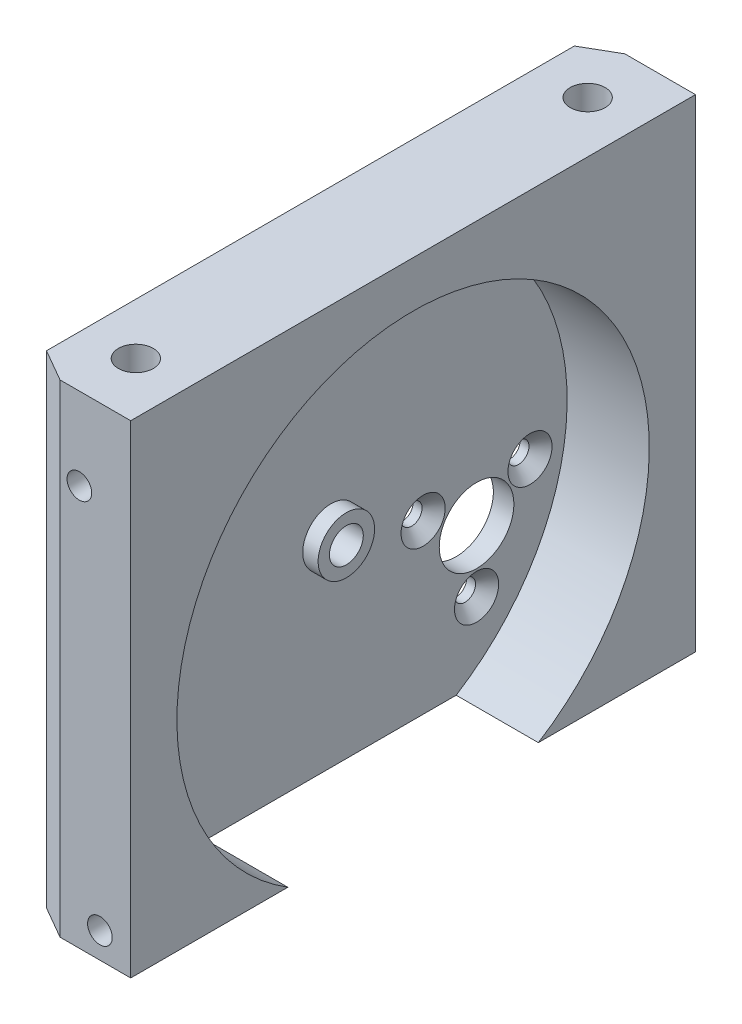
ISO-10303-21;
HEADER;
FILE_DESCRIPTION(('STEP AP214'),'2;1');
FILE_NAME('part.step','',(''),(''),'','','');
FILE_SCHEMA(('AUTOMOTIVE_DESIGN { 1 0 10303 214 1 1 1 1 }'));
ENDSEC;
DATA;
#1=APPLICATION_CONTEXT('core data for automotive mechanical design processes');
#2=APPLICATION_PROTOCOL_DEFINITION('international standard','automotive_design',2000,#1);
#3=PRODUCT_CONTEXT('',#1,'mechanical');
#4=PRODUCT('Part','Part','',(#3));
#5=PRODUCT_RELATED_PRODUCT_CATEGORY('part','',(#4));
#6=PRODUCT_DEFINITION_FORMATION('','',#4);
#7=PRODUCT_DEFINITION_CONTEXT('part definition',#1,'design');
#8=PRODUCT_DEFINITION('design','',#6,#7);
#9=PRODUCT_DEFINITION_SHAPE('','',#8);
#10=(LENGTH_UNIT() NAMED_UNIT(*) SI_UNIT(.MILLI.,.METRE.));
#11=(NAMED_UNIT(*) PLANE_ANGLE_UNIT() SI_UNIT($,.RADIAN.));
#12=(NAMED_UNIT(*) SI_UNIT($,.STERADIAN.) SOLID_ANGLE_UNIT());
#13=UNCERTAINTY_MEASURE_WITH_UNIT(LENGTH_MEASURE(1.E-05),#10,'distance_accuracy_value','');
#14=(GEOMETRIC_REPRESENTATION_CONTEXT(3) GLOBAL_UNCERTAINTY_ASSIGNED_CONTEXT((#13)) GLOBAL_UNIT_ASSIGNED_CONTEXT((#10,
#11,#12)) REPRESENTATION_CONTEXT('',''));
#15=CARTESIAN_POINT('',(0.,0.,0.));
#16=DIRECTION('',(0.,0.,1.));
#17=DIRECTION('',(1.,0.,0.));
#18=AXIS2_PLACEMENT_3D('',#15,#16,#17);
#19=CARTESIAN_POINT('',(2.,5.6254512635379,14.6813158662437));
#20=DIRECTION('',(1.,0.,0.));
#21=DIRECTION('',(0.,0.,-1.));
#22=AXIS2_PLACEMENT_3D('',#19,#20,#21);
#23=PLANE('',#22);
#24=CARTESIAN_POINT('',(2.,2.4504512635379,5.70631586624369));
#25=DIRECTION('',(1.,0.,0.));
#26=DIRECTION('',(0.,0.,-1.));
#27=AXIS2_PLACEMENT_3D('',#24,#25,#26);
#28=CIRCLE('',#27,2.15);
#29=CARTESIAN_POINT('',(2.,2.4504512635379,3.55631586624369));
#30=VERTEX_POINT('',#29);
#31=EDGE_CURVE('E126',#30,#30,#28,.T.);
#32=ORIENTED_EDGE('',*,*,#31,.F.);
#33=EDGE_LOOP('',(#32));
#34=FACE_BOUND('',#33,.T.);
#35=CARTESIAN_POINT('',(2.,2.4504512635379,-4.70368413375631));
#36=DIRECTION('',(1.,0.,0.));
#37=DIRECTION('',(0.,0.,-1.));
#38=AXIS2_PLACEMENT_3D('',#35,#36,#37);
#39=CIRCLE('',#38,2.15);
#40=CARTESIAN_POINT('',(2.,2.4504512635379,-6.85368413375631));
#41=VERTEX_POINT('',#40);
#42=EDGE_CURVE('E135',#41,#41,#39,.T.);
#43=ORIENTED_EDGE('',*,*,#42,.F.);
#44=EDGE_LOOP('',(#43));
#45=FACE_BOUND('',#44,.T.);
#46=CARTESIAN_POINT('',(2.,-6.5645487364621,0.501315866243686));
#47=DIRECTION('',(1.,0.,0.));
#48=DIRECTION('',(0.,0.,-1.));
#49=AXIS2_PLACEMENT_3D('',#46,#47,#48);
#50=CIRCLE('',#49,2.15);
#51=CARTESIAN_POINT('',(2.,-6.5645487364621,-1.64868413375631));
#52=VERTEX_POINT('',#51);
#53=EDGE_CURVE('E144',#52,#52,#50,.T.);
#54=ORIENTED_EDGE('',*,*,#53,.F.);
#55=EDGE_LOOP('',(#54));
#56=FACE_BOUND('',#55,.T.);
#57=CARTESIAN_POINT('',(2.,-0.5545487364621,0.501315866243685));
#58=DIRECTION('',(1.,0.,0.));
#59=DIRECTION('',(0.,0.,-1.));
#60=AXIS2_PLACEMENT_3D('',#57,#58,#59);
#61=CIRCLE('',#60,3.635);
#62=CARTESIAN_POINT('',(2.,-0.5545487364621,-3.13368413375632));
#63=VERTEX_POINT('',#62);
#64=EDGE_CURVE('E156',#63,#63,#61,.T.);
#65=ORIENTED_EDGE('',*,*,#64,.F.);
#66=EDGE_LOOP('',(#65));
#67=FACE_BOUND('',#66,.T.);
#68=DIRECTION('',(0.,0.,-1.));
#69=VECTOR('',#68,1.);
#70=CARTESIAN_POINT('',(2.,-13.8745487364621,42.1813158662437));
#71=LINE('',#70,#69);
#72=CARTESIAN_POINT('',(2.,-13.8745487364621,26.8776267838942));
#73=VERTEX_POINT('',#72);
#74=CARTESIAN_POINT('',(2.,-13.8745487364621,2.48500494859321));
#75=VERTEX_POINT('',#74);
#76=EDGE_CURVE('E234',#73,#75,#71,.T.);
#77=ORIENTED_EDGE('',*,*,#76,.T.);
#78=CARTESIAN_POINT('',(2.,5.6254512635379,14.6813158662437));
#79=DIRECTION('',(1.,0.,0.));
#80=DIRECTION('',(0.,0.,-1.));
#81=AXIS2_PLACEMENT_3D('',#78,#79,#80);
#82=CIRCLE('',#81,23.);
#83=EDGE_CURVE('E193',#75,#73,#82,.T.);
#84=ORIENTED_EDGE('',*,*,#83,.T.);
#85=EDGE_LOOP('',(#77,#84));
#86=FACE_BOUND('',#85,.T.);
#87=CARTESIAN_POINT('',(2.,5.6254512635379,14.6813158662437));
#88=DIRECTION('',(1.,0.,0.));
#89=DIRECTION('',(0.,0.,-1.));
#90=AXIS2_PLACEMENT_3D('',#87,#88,#89);
#91=CIRCLE('',#90,2.75);
#92=CARTESIAN_POINT('',(2.,5.6254512635379,11.9313158662437));
#93=VERTEX_POINT('',#92);
#94=EDGE_CURVE('E165',#93,#93,#91,.T.);
#95=ORIENTED_EDGE('',*,*,#94,.F.);
#96=EDGE_LOOP('',(#95));
#97=FACE_BOUND('',#96,.T.);
#98=ADVANCED_FACE('F34',(#34,#45,#56,#67,#86,#97),#23,.T.);
#99=CARTESIAN_POINT('',(10.,33.1254512635379,42.1813158662437));
#100=DIRECTION('',(0.,0.,-1.));
#101=DIRECTION('',(-1.,0.,0.));
#102=AXIS2_PLACEMENT_3D('',#99,#100,#101);
#103=PLANE('',#102);
#104=CARTESIAN_POINT('',(7.,-11.3745487364621,42.1813158662437));
#105=DIRECTION('',(0.,0.,1.));
#106=DIRECTION('',(1.,0.,0.));
#107=AXIS2_PLACEMENT_3D('',#104,#105,#106);
#108=CIRCLE('',#107,1.2);
#109=CARTESIAN_POINT('',(8.2,-11.3745487364621,42.1813158662437));
#110=VERTEX_POINT('',#109);
#111=EDGE_CURVE('E181',#110,#110,#108,.T.);
#112=ORIENTED_EDGE('',*,*,#111,.F.);
#113=EDGE_LOOP('',(#112));
#114=FACE_BOUND('',#113,.T.);
#115=CARTESIAN_POINT('',(5.,25.1254512635379,42.1813158662437));
#116=DIRECTION('',(0.,0.,1.));
#117=DIRECTION('',(1.,0.,0.));
#118=AXIS2_PLACEMENT_3D('',#115,#116,#117);
#119=CIRCLE('',#118,1.2);
#120=CARTESIAN_POINT('',(6.2,25.1254512635379,42.1813158662437));
#121=VERTEX_POINT('',#120);
#122=EDGE_CURVE('E187',#121,#121,#119,.T.);
#123=ORIENTED_EDGE('',*,*,#122,.F.);
#124=EDGE_LOOP('',(#123));
#125=FACE_BOUND('',#124,.T.);
#126=DIRECTION('',(-1.,0.,0.));
#127=VECTOR('',#126,1.);
#128=CARTESIAN_POINT('',(10.,33.1254512635379,42.1813158662437));
#129=LINE('',#128,#127);
#130=CARTESIAN_POINT('',(10.,33.1254512635379,42.1813158662437));
#131=VERTEX_POINT('',#130);
#132=CARTESIAN_POINT('',(3.11769145362399,33.1254512635379,42.1813158662437));
#133=VERTEX_POINT('',#132);
#134=EDGE_CURVE('E217',#131,#133,#129,.T.);
#135=ORIENTED_EDGE('',*,*,#134,.T.);
#136=DIRECTION('',(0.,-1.,0.));
#137=VECTOR('',#136,1.);
#138=CARTESIAN_POINT('',(3.11769145362398,33.1254512635379,42.1813158662437));
#139=LINE('',#138,#137);
#140=CARTESIAN_POINT('',(3.11769145362399,-13.8745487364621,42.1813158662437));
#141=VERTEX_POINT('',#140);
#142=EDGE_CURVE('E236',#133,#141,#139,.T.);
#143=ORIENTED_EDGE('',*,*,#142,.T.);
#144=DIRECTION('',(-1.,0.,0.));
#145=VECTOR('',#144,1.);
#146=CARTESIAN_POINT('',(10.,-13.8745487364621,42.1813158662437));
#147=LINE('',#146,#145);
#148=CARTESIAN_POINT('',(10.,-13.8745487364621,42.1813158662437));
#149=VERTEX_POINT('',#148);
#150=EDGE_CURVE('E229',#149,#141,#147,.T.);
#151=ORIENTED_EDGE('',*,*,#150,.F.);
#152=DIRECTION('',(0.,-1.,0.));
#153=VECTOR('',#152,1.);
#154=CARTESIAN_POINT('',(10.,33.1254512635379,42.1813158662437));
#155=LINE('',#154,#153);
#156=EDGE_CURVE('E205',#131,#149,#155,.T.);
#157=ORIENTED_EDGE('',*,*,#156,.F.);
#158=EDGE_LOOP('',(#135,#143,#151,#157));
#159=FACE_BOUND('',#158,.T.);
#160=ADVANCED_FACE('F255',(#114,#125,#159),#103,.F.);
#161=CARTESIAN_POINT('',(10.,-13.8745487364621,42.1813158662437));
#162=DIRECTION('',(0.,1.,0.));
#163=DIRECTION('',(0.,0.,1.));
#164=AXIS2_PLACEMENT_3D('',#161,#162,#163);
#165=PLANE('',#164);
#166=ORIENTED_EDGE('',*,*,#150,.T.);
#167=DIRECTION('',(0.866025403784438,0.,0.500000000000001));
#168=VECTOR('',#167,1.);
#169=CARTESIAN_POINT('',(3.11769145362398,-13.8745487364621,42.1813158662437));
#170=LINE('',#169,#168);
#171=CARTESIAN_POINT('',(0.,-13.8745487364621,40.3813158662437));
#172=VERTEX_POINT('',#171);
#173=EDGE_CURVE('E241',#141,#172,#170,.F.);
#174=ORIENTED_EDGE('',*,*,#173,.T.);
#175=DIRECTION('',(0.,0.,-1.));
#176=VECTOR('',#175,1.);
#177=CARTESIAN_POINT('',(0.,-13.8745487364621,42.1813158662437));
#178=LINE('',#177,#176);
#179=CARTESIAN_POINT('',(0.,-13.8745487364621,-11.0186841337563));
#180=VERTEX_POINT('',#179);
#181=EDGE_CURVE('E204',#172,#180,#178,.T.);
#182=ORIENTED_EDGE('',*,*,#181,.T.);
#183=DIRECTION('',(-0.866025403784439,0.,0.499999999999999));
#184=VECTOR('',#183,1.);
#185=CARTESIAN_POINT('',(3.11769145362397,-13.8745487364621,-12.8186841337563));
#186=LINE('',#185,#184);
#187=CARTESIAN_POINT('',(3.11769145362398,-13.8745487364621,-12.8186841337563));
#188=VERTEX_POINT('',#187);
#189=EDGE_CURVE('E239',#180,#188,#186,.F.);
#190=ORIENTED_EDGE('',*,*,#189,.T.);
#191=DIRECTION('',(-1.,0.,0.));
#192=VECTOR('',#191,1.);
#193=CARTESIAN_POINT('',(10.,-13.8745487364621,-12.8186841337563));
#194=LINE('',#193,#192);
#195=CARTESIAN_POINT('',(10.,-13.8745487364621,-12.8186841337563));
#196=VERTEX_POINT('',#195);
#197=EDGE_CURVE('E226',#196,#188,#194,.T.);
#198=ORIENTED_EDGE('',*,*,#197,.F.);
#199=DIRECTION('',(0.,0.,-1.));
#200=VECTOR('',#199,1.);
#201=CARTESIAN_POINT('',(10.,-13.8745487364621,42.1813158662437));
#202=LINE('',#201,#200);
#203=CARTESIAN_POINT('',(10.,-13.8745487364621,2.48500494859321));
#204=VERTEX_POINT('',#203);
#205=EDGE_CURVE('E208',#204,#196,#202,.T.);
#206=ORIENTED_EDGE('',*,*,#205,.F.);
#207=DIRECTION('',(1.,0.,0.));
#208=VECTOR('',#207,1.);
#209=CARTESIAN_POINT('',(2.,-13.8745487364621,2.48500494859321));
#210=LINE('',#209,#208);
#211=EDGE_CURVE('E198',#204,#75,#210,.F.);
#212=ORIENTED_EDGE('',*,*,#211,.T.);
#213=ORIENTED_EDGE('',*,*,#76,.F.);
#214=DIRECTION('',(1.,0.,0.));
#215=VECTOR('',#214,1.);
#216=CARTESIAN_POINT('',(2.,-13.8745487364621,26.8776267838942));
#217=LINE('',#216,#215);
#218=CARTESIAN_POINT('',(10.,-13.8745487364621,26.8776267838942));
#219=VERTEX_POINT('',#218);
#220=EDGE_CURVE('E201',#73,#219,#217,.T.);
#221=ORIENTED_EDGE('',*,*,#220,.T.);
#222=EDGE_CURVE('E210',#149,#219,#202,.T.);
#223=ORIENTED_EDGE('',*,*,#222,.F.);
#224=EDGE_LOOP('',(#166,#174,#182,#190,#198,#206,#212,#213,#221,#223));
#225=FACE_BOUND('',#224,.T.);
#226=ADVANCED_FACE('F259',(#225),#165,.F.);
#227=CARTESIAN_POINT('',(10.,33.1254512635379,-12.8186841337563));
#228=DIRECTION('',(0.,0.,1.));
#229=DIRECTION('',(0.,-1.,0.));
#230=AXIS2_PLACEMENT_3D('',#227,#228,#229);
#231=PLANE('',#230);
#232=CARTESIAN_POINT('',(7.,-11.3745487364621,-12.8186841337563));
#233=DIRECTION('',(0.,0.,-1.));
#234=DIRECTION('',(0.,1.,0.));
#235=AXIS2_PLACEMENT_3D('',#232,#233,#234);
#236=CIRCLE('',#235,1.2);
#237=CARTESIAN_POINT('',(7.,-10.1745487364621,-12.8186841337563));
#238=VERTEX_POINT('',#237);
#239=EDGE_CURVE('E169',#238,#238,#236,.T.);
#240=ORIENTED_EDGE('',*,*,#239,.F.);
#241=EDGE_LOOP('',(#240));
#242=FACE_BOUND('',#241,.T.);
#243=CARTESIAN_POINT('',(5.,25.1254512635379,-12.8186841337563));
#244=DIRECTION('',(0.,0.,-1.));
#245=DIRECTION('',(0.,1.,0.));
#246=AXIS2_PLACEMENT_3D('',#243,#244,#245);
#247=CIRCLE('',#246,1.2);
#248=CARTESIAN_POINT('',(5.,26.3254512635379,-12.8186841337563));
#249=VERTEX_POINT('',#248);
#250=EDGE_CURVE('E175',#249,#249,#247,.T.);
#251=ORIENTED_EDGE('',*,*,#250,.F.);
#252=EDGE_LOOP('',(#251));
#253=FACE_BOUND('',#252,.T.);
#254=ORIENTED_EDGE('',*,*,#197,.T.);
#255=DIRECTION('',(0.,1.,0.));
#256=VECTOR('',#255,1.);
#257=CARTESIAN_POINT('',(3.11769145362398,33.1254512635379,-12.8186841337563));
#258=LINE('',#257,#256);
#259=CARTESIAN_POINT('',(3.11769145362398,33.1254512635379,-12.8186841337563));
#260=VERTEX_POINT('',#259);
#261=EDGE_CURVE('E11',#188,#260,#258,.T.);
#262=ORIENTED_EDGE('',*,*,#261,.T.);
#263=DIRECTION('',(-1.,0.,0.));
#264=VECTOR('',#263,1.);
#265=CARTESIAN_POINT('',(10.,33.1254512635379,-12.8186841337563));
#266=LINE('',#265,#264);
#267=CARTESIAN_POINT('',(10.,33.1254512635379,-12.8186841337563));
#268=VERTEX_POINT('',#267);
#269=EDGE_CURVE('E223',#268,#260,#266,.T.);
#270=ORIENTED_EDGE('',*,*,#269,.F.);
#271=DIRECTION('',(0.,1.,0.));
#272=VECTOR('',#271,1.);
#273=CARTESIAN_POINT('',(10.,33.1254512635379,-12.8186841337563));
#274=LINE('',#273,#272);
#275=EDGE_CURVE('E213',#196,#268,#274,.T.);
#276=ORIENTED_EDGE('',*,*,#275,.F.);
#277=EDGE_LOOP('',(#254,#262,#270,#276));
#278=FACE_BOUND('',#277,.T.);
#279=ADVANCED_FACE('F266',(#242,#253,#278),#231,.F.);
#280=CARTESIAN_POINT('',(10.,33.1254512635379,42.1813158662437));
#281=DIRECTION('',(0.,-1.,0.));
#282=DIRECTION('',(0.,0.,-1.));
#283=AXIS2_PLACEMENT_3D('',#280,#281,#282);
#284=PLANE('',#283);
#285=CARTESIAN_POINT('',(5.,33.1254512635379,-7.31868413375631));
#286=DIRECTION('',(0.,1.,0.));
#287=DIRECTION('',(0.,0.,1.));
#288=AXIS2_PLACEMENT_3D('',#285,#286,#287);
#289=CIRCLE('',#288,1.7);
#290=CARTESIAN_POINT('',(5.,33.1254512635379,-5.61868413375631));
#291=VERTEX_POINT('',#290);
#292=EDGE_CURVE('E116',#291,#291,#289,.T.);
#293=ORIENTED_EDGE('',*,*,#292,.F.);
#294=EDGE_LOOP('',(#293));
#295=FACE_BOUND('',#294,.T.);
#296=CARTESIAN_POINT('',(5.,33.1254512635379,36.6813158662437));
#297=DIRECTION('',(0.,1.,0.));
#298=DIRECTION('',(0.,0.,1.));
#299=AXIS2_PLACEMENT_3D('',#296,#297,#298);
#300=CIRCLE('',#299,1.7);
#301=CARTESIAN_POINT('',(5.,33.1254512635379,38.3813158662437));
#302=VERTEX_POINT('',#301);
#303=EDGE_CURVE('E115',#302,#302,#300,.T.);
#304=ORIENTED_EDGE('',*,*,#303,.F.);
#305=EDGE_LOOP('',(#304));
#306=FACE_BOUND('',#305,.T.);
#307=DIRECTION('',(0.,0.,1.));
#308=VECTOR('',#307,1.);
#309=CARTESIAN_POINT('',(0.,33.1254512635379,42.1813158662437));
#310=LINE('',#309,#308);
#311=CARTESIAN_POINT('',(0.,33.1254512635379,-11.0186841337563));
#312=VERTEX_POINT('',#311);
#313=CARTESIAN_POINT('',(0.,33.1254512635379,40.3813158662437));
#314=VERTEX_POINT('',#313);
#315=EDGE_CURVE('E209',#312,#314,#310,.T.);
#316=ORIENTED_EDGE('',*,*,#315,.T.);
#317=DIRECTION('',(-0.866025403784438,0.,-0.500000000000001));
#318=VECTOR('',#317,1.);
#319=CARTESIAN_POINT('',(3.11769145362398,33.1254512635379,42.1813158662437));
#320=LINE('',#319,#318);
#321=EDGE_CURVE('E42',#314,#133,#320,.F.);
#322=ORIENTED_EDGE('',*,*,#321,.T.);
#323=ORIENTED_EDGE('',*,*,#134,.F.);
#324=DIRECTION('',(0.,0.,1.));
#325=VECTOR('',#324,1.);
#326=CARTESIAN_POINT('',(10.,33.1254512635379,42.1813158662437));
#327=LINE('',#326,#325);
#328=EDGE_CURVE('E215',#268,#131,#327,.T.);
#329=ORIENTED_EDGE('',*,*,#328,.F.);
#330=ORIENTED_EDGE('',*,*,#269,.T.);
#331=DIRECTION('',(0.866025403784439,0.,-0.499999999999999));
#332=VECTOR('',#331,1.);
#333=CARTESIAN_POINT('',(3.11769145362398,33.1254512635379,-12.8186841337563));
#334=LINE('',#333,#332);
#335=EDGE_CURVE('E49',#260,#312,#334,.F.);
#336=ORIENTED_EDGE('',*,*,#335,.T.);
#337=EDGE_LOOP('',(#316,#322,#323,#329,#330,#336));
#338=FACE_BOUND('',#337,.T.);
#339=ADVANCED_FACE('F249',(#295,#306,#338),#284,.F.);
#340=CARTESIAN_POINT('',(10.,-13.8745487364621,42.1813158662437));
#341=DIRECTION('',(1.,0.,0.));
#342=DIRECTION('',(0.,0.,-1.));
#343=AXIS2_PLACEMENT_3D('',#340,#341,#342);
#344=PLANE('',#343);
#345=CARTESIAN_POINT('',(10.,5.6254512635379,14.6813158662437));
#346=DIRECTION('',(1.,0.,0.));
#347=DIRECTION('',(0.,0.,-1.));
#348=AXIS2_PLACEMENT_3D('',#345,#346,#347);
#349=CIRCLE('',#348,23.);
#350=EDGE_CURVE('E232',#204,#219,#349,.T.);
#351=ORIENTED_EDGE('',*,*,#350,.F.);
#352=ORIENTED_EDGE('',*,*,#205,.T.);
#353=ORIENTED_EDGE('',*,*,#275,.T.);
#354=ORIENTED_EDGE('',*,*,#328,.T.);
#355=ORIENTED_EDGE('',*,*,#156,.T.);
#356=ORIENTED_EDGE('',*,*,#222,.T.);
#357=EDGE_LOOP('',(#351,#352,#353,#354,#355,#356));
#358=FACE_BOUND('',#357,.T.);
#359=ADVANCED_FACE('F270',(#358),#344,.T.);
#360=CARTESIAN_POINT('',(0.,-13.8745487364621,42.1813158662437));
#361=DIRECTION('',(1.,0.,0.));
#362=DIRECTION('',(0.,0.,-1.));
#363=AXIS2_PLACEMENT_3D('',#360,#361,#362);
#364=PLANE('',#363);
#365=CARTESIAN_POINT('',(0.,2.4504512635379,5.70631586624369));
#366=DIRECTION('',(1.,0.,0.));
#367=DIRECTION('',(0.,0.,-1.));
#368=AXIS2_PLACEMENT_3D('',#365,#366,#367);
#369=CIRCLE('',#368,1.025);
#370=CARTESIAN_POINT('',(0.,2.4504512635379,4.68131586624369));
#371=VERTEX_POINT('',#370);
#372=EDGE_CURVE('E132',#371,#371,#369,.T.);
#373=ORIENTED_EDGE('',*,*,#372,.T.);
#374=EDGE_LOOP('',(#373));
#375=FACE_BOUND('',#374,.T.);
#376=CARTESIAN_POINT('',(0.,2.4504512635379,-4.70368413375631));
#377=DIRECTION('',(1.,0.,0.));
#378=DIRECTION('',(0.,0.,-1.));
#379=AXIS2_PLACEMENT_3D('',#376,#377,#378);
#380=CIRCLE('',#379,1.025);
#381=CARTESIAN_POINT('',(0.,2.4504512635379,-5.72868413375631));
#382=VERTEX_POINT('',#381);
#383=EDGE_CURVE('E141',#382,#382,#380,.T.);
#384=ORIENTED_EDGE('',*,*,#383,.T.);
#385=EDGE_LOOP('',(#384));
#386=FACE_BOUND('',#385,.T.);
#387=CARTESIAN_POINT('',(0.,-6.5645487364621,0.501315866243686));
#388=DIRECTION('',(1.,0.,0.));
#389=DIRECTION('',(0.,0.,-1.));
#390=AXIS2_PLACEMENT_3D('',#387,#388,#389);
#391=CIRCLE('',#390,1.025);
#392=CARTESIAN_POINT('',(0.,-6.5645487364621,-0.523684133756313));
#393=VERTEX_POINT('',#392);
#394=EDGE_CURVE('E150',#393,#393,#391,.T.);
#395=ORIENTED_EDGE('',*,*,#394,.T.);
#396=EDGE_LOOP('',(#395));
#397=FACE_BOUND('',#396,.T.);
#398=CARTESIAN_POINT('',(0.,-0.5545487364621,0.501315866243685));
#399=DIRECTION('',(-1.,0.,0.));
#400=DIRECTION('',(0.,0.,1.));
#401=AXIS2_PLACEMENT_3D('',#398,#399,#400);
#402=CIRCLE('',#401,3.635);
#403=CARTESIAN_POINT('',(0.,-0.5545487364621,4.13631586624368));
#404=VERTEX_POINT('',#403);
#405=EDGE_CURVE('E153',#404,#404,#402,.T.);
#406=ORIENTED_EDGE('',*,*,#405,.F.);
#407=EDGE_LOOP('',(#406));
#408=FACE_BOUND('',#407,.T.);
#409=CARTESIAN_POINT('',(0.,5.6254512635379,14.6813158662437));
#410=DIRECTION('',(1.,0.,0.));
#411=DIRECTION('',(0.,0.,-1.));
#412=AXIS2_PLACEMENT_3D('',#409,#410,#411);
#413=CIRCLE('',#412,1.65);
#414=CARTESIAN_POINT('',(0.,5.6254512635379,13.0313158662437));
#415=VERTEX_POINT('',#414);
#416=EDGE_CURVE('E159',#415,#415,#413,.T.);
#417=ORIENTED_EDGE('',*,*,#416,.T.);
#418=EDGE_LOOP('',(#417));
#419=FACE_BOUND('',#418,.T.);
#420=ORIENTED_EDGE('',*,*,#181,.F.);
#421=DIRECTION('',(0.,1.,0.));
#422=VECTOR('',#421,1.);
#423=CARTESIAN_POINT('',(0.,-13.8745487364621,40.3813158662437));
#424=LINE('',#423,#422);
#425=EDGE_CURVE('E56',#172,#314,#424,.T.);
#426=ORIENTED_EDGE('',*,*,#425,.T.);
#427=ORIENTED_EDGE('',*,*,#315,.F.);
#428=DIRECTION('',(0.,-1.,0.));
#429=VECTOR('',#428,1.);
#430=CARTESIAN_POINT('',(0.,-13.8745487364621,-11.0186841337563));
#431=LINE('',#430,#429);
#432=EDGE_CURVE('E243',#312,#180,#431,.T.);
#433=ORIENTED_EDGE('',*,*,#432,.T.);
#434=EDGE_LOOP('',(#420,#426,#427,#433));
#435=FACE_BOUND('',#434,.T.);
#436=ADVANCED_FACE('F261',(#375,#386,#397,#408,#419,#435),#364,.F.);
#437=CARTESIAN_POINT('',(2.,5.6254512635379,14.6813158662437));
#438=DIRECTION('',(1.,0.,0.));
#439=DIRECTION('',(0.,0.,-1.));
#440=AXIS2_PLACEMENT_3D('',#437,#438,#439);
#441=CYLINDRICAL_SURFACE('',#440,23.);
#442=ORIENTED_EDGE('',*,*,#83,.F.);
#443=ORIENTED_EDGE('',*,*,#211,.F.);
#444=ORIENTED_EDGE('',*,*,#350,.T.);
#445=ORIENTED_EDGE('',*,*,#220,.F.);
#446=EDGE_LOOP('',(#442,#443,#444,#445));
#447=FACE_BOUND('',#446,.T.);
#448=ADVANCED_FACE('F274',(#447),#441,.F.);
#449=CARTESIAN_POINT('',(5.,25.1254512635379,36.1813158662437));
#450=DIRECTION('',(0.,0.,1.));
#451=DIRECTION('',(1.,0.,0.));
#452=AXIS2_PLACEMENT_3D('',#449,#450,#451);
#453=CYLINDRICAL_SURFACE('',#452,1.2);
#454=CARTESIAN_POINT('',(5.,25.1254512635379,36.1813158662437));
#455=DIRECTION('',(0.,0.,1.));
#456=DIRECTION('',(1.,0.,0.));
#457=AXIS2_PLACEMENT_3D('',#454,#455,#456);
#458=CIRCLE('',#457,1.2);
#459=CARTESIAN_POINT('',(6.2,25.1254512635379,36.1813158662437));
#460=VERTEX_POINT('',#459);
#461=EDGE_CURVE('E190',#460,#460,#458,.T.);
#462=ORIENTED_EDGE('',*,*,#461,.F.);
#463=EDGE_LOOP('',(#462));
#464=FACE_BOUND('',#463,.T.);
#465=ORIENTED_EDGE('',*,*,#122,.T.);
#466=EDGE_LOOP('',(#465));
#467=FACE_BOUND('',#466,.T.);
#468=ADVANCED_FACE('F326',(#464,#467),#453,.F.);
#469=CARTESIAN_POINT('',(5.,25.1254512635379,36.1813158662437));
#470=DIRECTION('',(0.,0.,1.));
#471=DIRECTION('',(1.,0.,0.));
#472=AXIS2_PLACEMENT_3D('',#469,#470,#471);
#473=PLANE('',#472);
#474=ORIENTED_EDGE('',*,*,#461,.T.);
#475=EDGE_LOOP('',(#474));
#476=FACE_BOUND('',#475,.T.);
#477=ADVANCED_FACE('F322',(#476),#473,.T.);
#478=CARTESIAN_POINT('',(7.,-11.3745487364621,36.1813158662437));
#479=DIRECTION('',(0.,0.,1.));
#480=DIRECTION('',(1.,0.,0.));
#481=AXIS2_PLACEMENT_3D('',#478,#479,#480);
#482=CYLINDRICAL_SURFACE('',#481,1.2);
#483=CARTESIAN_POINT('',(7.,-11.3745487364621,36.1813158662437));
#484=DIRECTION('',(0.,0.,1.));
#485=DIRECTION('',(1.,0.,0.));
#486=AXIS2_PLACEMENT_3D('',#483,#484,#485);
#487=CIRCLE('',#486,1.2);
#488=CARTESIAN_POINT('',(8.2,-11.3745487364621,36.1813158662437));
#489=VERTEX_POINT('',#488);
#490=EDGE_CURVE('E184',#489,#489,#487,.T.);
#491=ORIENTED_EDGE('',*,*,#490,.F.);
#492=EDGE_LOOP('',(#491));
#493=FACE_BOUND('',#492,.T.);
#494=ORIENTED_EDGE('',*,*,#111,.T.);
#495=EDGE_LOOP('',(#494));
#496=FACE_BOUND('',#495,.T.);
#497=ADVANCED_FACE('F318',(#493,#496),#482,.F.);
#498=CARTESIAN_POINT('',(7.,-11.3745487364621,36.1813158662437));
#499=DIRECTION('',(0.,0.,1.));
#500=DIRECTION('',(1.,0.,0.));
#501=AXIS2_PLACEMENT_3D('',#498,#499,#500);
#502=PLANE('',#501);
#503=ORIENTED_EDGE('',*,*,#490,.T.);
#504=EDGE_LOOP('',(#503));
#505=FACE_BOUND('',#504,.T.);
#506=ADVANCED_FACE('F314',(#505),#502,.T.);
#507=CARTESIAN_POINT('',(5.,25.1254512635379,-6.81868413375631));
#508=DIRECTION('',(0.,0.,-1.));
#509=DIRECTION('',(0.,1.,0.));
#510=AXIS2_PLACEMENT_3D('',#507,#508,#509);
#511=CYLINDRICAL_SURFACE('',#510,1.2);
#512=CARTESIAN_POINT('',(5.,25.1254512635379,-6.81868413375631));
#513=DIRECTION('',(0.,0.,-1.));
#514=DIRECTION('',(0.,1.,0.));
#515=AXIS2_PLACEMENT_3D('',#512,#513,#514);
#516=CIRCLE('',#515,1.2);
#517=CARTESIAN_POINT('',(5.,26.3254512635379,-6.81868413375631));
#518=VERTEX_POINT('',#517);
#519=EDGE_CURVE('E178',#518,#518,#516,.T.);
#520=ORIENTED_EDGE('',*,*,#519,.F.);
#521=EDGE_LOOP('',(#520));
#522=FACE_BOUND('',#521,.T.);
#523=ORIENTED_EDGE('',*,*,#250,.T.);
#524=EDGE_LOOP('',(#523));
#525=FACE_BOUND('',#524,.T.);
#526=ADVANCED_FACE('F310',(#522,#525),#511,.F.);
#527=CARTESIAN_POINT('',(5.,25.1254512635379,-6.81868413375631));
#528=DIRECTION('',(0.,0.,-1.));
#529=DIRECTION('',(0.,1.,0.));
#530=AXIS2_PLACEMENT_3D('',#527,#528,#529);
#531=PLANE('',#530);
#532=ORIENTED_EDGE('',*,*,#519,.T.);
#533=EDGE_LOOP('',(#532));
#534=FACE_BOUND('',#533,.T.);
#535=ADVANCED_FACE('F306',(#534),#531,.T.);
#536=CARTESIAN_POINT('',(7.,-11.3745487364621,-6.81868413375632));
#537=DIRECTION('',(0.,0.,-1.));
#538=DIRECTION('',(0.,1.,0.));
#539=AXIS2_PLACEMENT_3D('',#536,#537,#538);
#540=CYLINDRICAL_SURFACE('',#539,1.2);
#541=CARTESIAN_POINT('',(7.,-11.3745487364621,-6.81868413375632));
#542=DIRECTION('',(0.,0.,-1.));
#543=DIRECTION('',(0.,1.,0.));
#544=AXIS2_PLACEMENT_3D('',#541,#542,#543);
#545=CIRCLE('',#544,1.2);
#546=CARTESIAN_POINT('',(7.,-10.1745487364621,-6.81868413375632));
#547=VERTEX_POINT('',#546);
#548=EDGE_CURVE('E172',#547,#547,#545,.T.);
#549=ORIENTED_EDGE('',*,*,#548,.F.);
#550=EDGE_LOOP('',(#549));
#551=FACE_BOUND('',#550,.T.);
#552=ORIENTED_EDGE('',*,*,#239,.T.);
#553=EDGE_LOOP('',(#552));
#554=FACE_BOUND('',#553,.T.);
#555=ADVANCED_FACE('F302',(#551,#554),#540,.F.);
#556=CARTESIAN_POINT('',(7.,-11.3745487364621,-6.81868413375632));
#557=DIRECTION('',(0.,0.,-1.));
#558=DIRECTION('',(0.,1.,0.));
#559=AXIS2_PLACEMENT_3D('',#556,#557,#558);
#560=PLANE('',#559);
#561=ORIENTED_EDGE('',*,*,#548,.T.);
#562=EDGE_LOOP('',(#561));
#563=FACE_BOUND('',#562,.T.);
#564=ADVANCED_FACE('F295',(#563),#560,.T.);
#565=CARTESIAN_POINT('',(3.5,5.6254512635379,14.6813158662437));
#566=DIRECTION('',(1.,0.,0.));
#567=DIRECTION('',(0.,0.,-1.));
#568=AXIS2_PLACEMENT_3D('',#565,#566,#567);
#569=PLANE('',#568);
#570=CARTESIAN_POINT('',(3.5,5.6254512635379,14.6813158662437));
#571=DIRECTION('',(1.,0.,0.));
#572=DIRECTION('',(0.,0.,-1.));
#573=AXIS2_PLACEMENT_3D('',#570,#571,#572);
#574=CIRCLE('',#573,2.75);
#575=CARTESIAN_POINT('',(3.5,5.6254512635379,11.9313158662437));
#576=VERTEX_POINT('',#575);
#577=EDGE_CURVE('E166',#576,#576,#574,.T.);
#578=ORIENTED_EDGE('',*,*,#577,.T.);
#579=EDGE_LOOP('',(#578));
#580=FACE_BOUND('',#579,.T.);
#581=CARTESIAN_POINT('',(3.5,5.6254512635379,14.6813158662437));
#582=DIRECTION('',(1.,0.,0.));
#583=DIRECTION('',(0.,0.,-1.));
#584=AXIS2_PLACEMENT_3D('',#581,#582,#583);
#585=CIRCLE('',#584,1.65);
#586=CARTESIAN_POINT('',(3.5,5.6254512635379,13.0313158662437));
#587=VERTEX_POINT('',#586);
#588=EDGE_CURVE('E162',#587,#587,#585,.T.);
#589=ORIENTED_EDGE('',*,*,#588,.F.);
#590=EDGE_LOOP('',(#589));
#591=FACE_BOUND('',#590,.T.);
#592=ADVANCED_FACE('F285',(#580,#591),#569,.T.);
#593=CARTESIAN_POINT('',(3.5,5.6254512635379,14.6813158662437));
#594=DIRECTION('',(-1.,0.,0.));
#595=DIRECTION('',(0.,0.,1.));
#596=AXIS2_PLACEMENT_3D('',#593,#594,#595);
#597=CYLINDRICAL_SURFACE('',#596,2.75);
#598=ORIENTED_EDGE('',*,*,#577,.F.);
#599=EDGE_LOOP('',(#598));
#600=FACE_BOUND('',#599,.T.);
#601=ORIENTED_EDGE('',*,*,#94,.T.);
#602=EDGE_LOOP('',(#601));
#603=FACE_BOUND('',#602,.T.);
#604=ADVANCED_FACE('F282',(#600,#603),#597,.T.);
#605=CARTESIAN_POINT('',(3.5,5.6254512635379,14.6813158662437));
#606=DIRECTION('',(-1.,0.,0.));
#607=DIRECTION('',(0.,0.,1.));
#608=AXIS2_PLACEMENT_3D('',#605,#606,#607);
#609=CYLINDRICAL_SURFACE('',#608,1.65);
#610=ORIENTED_EDGE('',*,*,#588,.T.);
#611=EDGE_LOOP('',(#610));
#612=FACE_BOUND('',#611,.T.);
#613=ORIENTED_EDGE('',*,*,#416,.F.);
#614=EDGE_LOOP('',(#613));
#615=FACE_BOUND('',#614,.T.);
#616=ADVANCED_FACE('F284',(#612,#615),#609,.F.);
#617=CARTESIAN_POINT('',(3.,-0.5545487364621,0.501315866243685));
#618=DIRECTION('',(-1.,0.,0.));
#619=DIRECTION('',(0.,0.,1.));
#620=AXIS2_PLACEMENT_3D('',#617,#618,#619);
#621=CYLINDRICAL_SURFACE('',#620,3.635);
#622=ORIENTED_EDGE('',*,*,#64,.T.);
#623=EDGE_LOOP('',(#622));
#624=FACE_BOUND('',#623,.T.);
#625=ORIENTED_EDGE('',*,*,#405,.T.);
#626=EDGE_LOOP('',(#625));
#627=FACE_BOUND('',#626,.T.);
#628=ADVANCED_FACE('F292',(#624,#627),#621,.F.);
#629=CARTESIAN_POINT('',(2.,-6.5645487364621,0.501315866243686));
#630=DIRECTION('',(1.,0.,0.));
#631=DIRECTION('',(0.,0.,-1.));
#632=AXIS2_PLACEMENT_3D('',#629,#630,#631);
#633=CYLINDRICAL_SURFACE('',#632,1.025);
#634=ORIENTED_EDGE('',*,*,#394,.F.);
#635=EDGE_LOOP('',(#634));
#636=FACE_BOUND('',#635,.T.);
#637=CARTESIAN_POINT('',(0.875,-6.5645487364621,0.501315866243686));
#638=DIRECTION('',(1.,0.,0.));
#639=DIRECTION('',(0.,0.,-1.));
#640=AXIS2_PLACEMENT_3D('',#637,#638,#639);
#641=CIRCLE('',#640,1.025);
#642=CARTESIAN_POINT('',(0.875,-6.5645487364621,-0.523684133756313));
#643=VERTEX_POINT('',#642);
#644=EDGE_CURVE('E147',#643,#643,#641,.T.);
#645=ORIENTED_EDGE('',*,*,#644,.T.);
#646=EDGE_LOOP('',(#645));
#647=FACE_BOUND('',#646,.T.);
#648=ADVANCED_FACE('F379',(#636,#647),#633,.F.);
#649=CARTESIAN_POINT('',(2.,-6.5645487364621,0.501315866243686));
#650=DIRECTION('',(1.,0.,0.));
#651=DIRECTION('',(0.,0.,-1.));
#652=AXIS2_PLACEMENT_3D('',#649,#650,#651);
#653=CONICAL_SURFACE('',#652,2.15,0.785398163397449);
#654=ORIENTED_EDGE('',*,*,#644,.F.);
#655=EDGE_LOOP('',(#654));
#656=FACE_BOUND('',#655,.T.);
#657=ORIENTED_EDGE('',*,*,#53,.T.);
#658=EDGE_LOOP('',(#657));
#659=FACE_BOUND('',#658,.T.);
#660=ADVANCED_FACE('F375',(#656,#659),#653,.F.);
#661=CARTESIAN_POINT('',(2.,2.4504512635379,-4.70368413375631));
#662=DIRECTION('',(1.,0.,0.));
#663=DIRECTION('',(0.,0.,-1.));
#664=AXIS2_PLACEMENT_3D('',#661,#662,#663);
#665=CYLINDRICAL_SURFACE('',#664,1.025);
#666=ORIENTED_EDGE('',*,*,#383,.F.);
#667=EDGE_LOOP('',(#666));
#668=FACE_BOUND('',#667,.T.);
#669=CARTESIAN_POINT('',(0.875,2.4504512635379,-4.70368413375631));
#670=DIRECTION('',(1.,0.,0.));
#671=DIRECTION('',(0.,0.,-1.));
#672=AXIS2_PLACEMENT_3D('',#669,#670,#671);
#673=CIRCLE('',#672,1.025);
#674=CARTESIAN_POINT('',(0.875,2.4504512635379,-5.72868413375631));
#675=VERTEX_POINT('',#674);
#676=EDGE_CURVE('E138',#675,#675,#673,.T.);
#677=ORIENTED_EDGE('',*,*,#676,.T.);
#678=EDGE_LOOP('',(#677));
#679=FACE_BOUND('',#678,.T.);
#680=ADVANCED_FACE('F371',(#668,#679),#665,.F.);
#681=CARTESIAN_POINT('',(2.,2.4504512635379,-4.70368413375631));
#682=DIRECTION('',(1.,0.,0.));
#683=DIRECTION('',(0.,0.,-1.));
#684=AXIS2_PLACEMENT_3D('',#681,#682,#683);
#685=CONICAL_SURFACE('',#684,2.15,0.785398163397448);
#686=ORIENTED_EDGE('',*,*,#676,.F.);
#687=EDGE_LOOP('',(#686));
#688=FACE_BOUND('',#687,.T.);
#689=ORIENTED_EDGE('',*,*,#42,.T.);
#690=EDGE_LOOP('',(#689));
#691=FACE_BOUND('',#690,.T.);
#692=ADVANCED_FACE('F361',(#688,#691),#685,.F.);
#693=CARTESIAN_POINT('',(2.,2.4504512635379,5.70631586624369));
#694=DIRECTION('',(1.,0.,0.));
#695=DIRECTION('',(0.,0.,-1.));
#696=AXIS2_PLACEMENT_3D('',#693,#694,#695);
#697=CYLINDRICAL_SURFACE('',#696,1.025);
#698=ORIENTED_EDGE('',*,*,#372,.F.);
#699=EDGE_LOOP('',(#698));
#700=FACE_BOUND('',#699,.T.);
#701=CARTESIAN_POINT('',(0.875,2.4504512635379,5.70631586624369));
#702=DIRECTION('',(1.,0.,0.));
#703=DIRECTION('',(0.,0.,-1.));
#704=AXIS2_PLACEMENT_3D('',#701,#702,#703);
#705=CIRCLE('',#704,1.025);
#706=CARTESIAN_POINT('',(0.875,2.4504512635379,4.68131586624369));
#707=VERTEX_POINT('',#706);
#708=EDGE_CURVE('E129',#707,#707,#705,.T.);
#709=ORIENTED_EDGE('',*,*,#708,.T.);
#710=EDGE_LOOP('',(#709));
#711=FACE_BOUND('',#710,.T.);
#712=ADVANCED_FACE('F355',(#700,#711),#697,.F.);
#713=CARTESIAN_POINT('',(2.,2.4504512635379,5.70631586624369));
#714=DIRECTION('',(1.,0.,0.));
#715=DIRECTION('',(0.,0.,-1.));
#716=AXIS2_PLACEMENT_3D('',#713,#714,#715);
#717=CONICAL_SURFACE('',#716,2.15,0.785398163397448);
#718=ORIENTED_EDGE('',*,*,#708,.F.);
#719=EDGE_LOOP('',(#718));
#720=FACE_BOUND('',#719,.T.);
#721=ORIENTED_EDGE('',*,*,#31,.T.);
#722=EDGE_LOOP('',(#721));
#723=FACE_BOUND('',#722,.T.);
#724=ADVANCED_FACE('F349',(#720,#723),#717,.F.);
#725=CARTESIAN_POINT('',(3.11769145362398,33.1254512635379,42.1813158662437));
#726=DIRECTION('',(0.500000000000001,0.,-0.866025403784438));
#727=DIRECTION('',(-0.866025403784438,0.,-0.500000000000001));
#728=AXIS2_PLACEMENT_3D('',#725,#726,#727);
#729=PLANE('',#728);
#730=ORIENTED_EDGE('',*,*,#321,.F.);
#731=ORIENTED_EDGE('',*,*,#425,.F.);
#732=ORIENTED_EDGE('',*,*,#173,.F.);
#733=ORIENTED_EDGE('',*,*,#142,.F.);
#734=EDGE_LOOP('',(#730,#731,#732,#733));
#735=FACE_BOUND('',#734,.T.);
#736=ADVANCED_FACE('F257',(#735),#729,.F.);
#737=CARTESIAN_POINT('',(3.11769145362398,33.1254512635379,-12.8186841337563));
#738=DIRECTION('',(0.499999999999999,0.,0.866025403784439));
#739=DIRECTION('',(0.866025403784439,0.,-0.499999999999999));
#740=AXIS2_PLACEMENT_3D('',#737,#738,#739);
#741=PLANE('',#740);
#742=ORIENTED_EDGE('',*,*,#189,.F.);
#743=ORIENTED_EDGE('',*,*,#432,.F.);
#744=ORIENTED_EDGE('',*,*,#335,.F.);
#745=ORIENTED_EDGE('',*,*,#261,.F.);
#746=EDGE_LOOP('',(#742,#743,#744,#745));
#747=FACE_BOUND('',#746,.T.);
#748=ADVANCED_FACE('F36',(#747),#741,.F.);
#749=CARTESIAN_POINT('',(5.,29.1254512635379,36.6813158662437));
#750=DIRECTION('',(0.,1.,0.));
#751=DIRECTION('',(0.,0.,1.));
#752=AXIS2_PLACEMENT_3D('',#749,#750,#751);
#753=CONICAL_SURFACE('',#752,1.7,1.02974425867665);
#754=CARTESIAN_POINT('',(5.,28.103988211191,36.6813158662437));
#755=VERTEX_POINT('',#754);
#756=VERTEX_LOOP('',#755);
#757=FACE_BOUND('',#756,.T.);
#758=CARTESIAN_POINT('',(5.,29.1254512635379,36.6813158662437));
#759=DIRECTION('',(0.,1.,0.));
#760=DIRECTION('',(0.,0.,1.));
#761=AXIS2_PLACEMENT_3D('',#758,#759,#760);
#762=CIRCLE('',#761,1.7);
#763=CARTESIAN_POINT('',(5.,29.1254512635379,38.3813158662437));
#764=VERTEX_POINT('',#763);
#765=EDGE_CURVE('E119',#764,#764,#762,.T.);
#766=ORIENTED_EDGE('',*,*,#765,.T.);
#767=EDGE_LOOP('',(#766));
#768=FACE_BOUND('',#767,.T.);
#769=ADVANCED_FACE('F354',(#757,#768),#753,.F.);
#770=CARTESIAN_POINT('',(5.,33.1254512635379,36.6813158662437));
#771=DIRECTION('',(0.,1.,0.));
#772=DIRECTION('',(0.,0.,1.));
#773=AXIS2_PLACEMENT_3D('',#770,#771,#772);
#774=CYLINDRICAL_SURFACE('',#773,1.7);
#775=ORIENTED_EDGE('',*,*,#765,.F.);
#776=EDGE_LOOP('',(#775));
#777=FACE_BOUND('',#776,.T.);
#778=ORIENTED_EDGE('',*,*,#303,.T.);
#779=EDGE_LOOP('',(#778));
#780=FACE_BOUND('',#779,.T.);
#781=ADVANCED_FACE('F109',(#777,#780),#774,.F.);
#782=CARTESIAN_POINT('',(5.,29.1254512635379,-7.31868413375631));
#783=DIRECTION('',(0.,1.,0.));
#784=DIRECTION('',(0.,0.,1.));
#785=AXIS2_PLACEMENT_3D('',#782,#783,#784);
#786=CONICAL_SURFACE('',#785,1.7,1.02974425867665);
#787=CARTESIAN_POINT('',(5.,28.103988211191,-7.31868413375631));
#788=VERTEX_POINT('',#787);
#789=VERTEX_LOOP('',#788);
#790=FACE_BOUND('',#789,.T.);
#791=CARTESIAN_POINT('',(5.,29.1254512635379,-7.31868413375631));
#792=DIRECTION('',(0.,1.,0.));
#793=DIRECTION('',(0.,0.,1.));
#794=AXIS2_PLACEMENT_3D('',#791,#792,#793);
#795=CIRCLE('',#794,1.7);
#796=CARTESIAN_POINT('',(5.,29.1254512635379,-5.61868413375631));
#797=VERTEX_POINT('',#796);
#798=EDGE_CURVE('E113',#797,#797,#795,.T.);
#799=ORIENTED_EDGE('',*,*,#798,.T.);
#800=EDGE_LOOP('',(#799));
#801=FACE_BOUND('',#800,.T.);
#802=ADVANCED_FACE('F105',(#790,#801),#786,.F.);
#803=CARTESIAN_POINT('',(5.,33.1254512635379,-7.31868413375631));
#804=DIRECTION('',(0.,1.,0.));
#805=DIRECTION('',(0.,0.,1.));
#806=AXIS2_PLACEMENT_3D('',#803,#804,#805);
#807=CYLINDRICAL_SURFACE('',#806,1.7);
#808=ORIENTED_EDGE('',*,*,#798,.F.);
#809=EDGE_LOOP('',(#808));
#810=FACE_BOUND('',#809,.T.);
#811=ORIENTED_EDGE('',*,*,#292,.T.);
#812=EDGE_LOOP('',(#811));
#813=FACE_BOUND('',#812,.T.);
#814=ADVANCED_FACE('F108',(#810,#813),#807,.F.);
#815=CLOSED_SHELL('',(#98,#160,#226,#279,#339,#359,#436,#448,#468,#477,#497,#506,#526,#535,#555,
#564,#592,#604,#616,#628,#648,#660,#680,#692,#712,#724,#736,#748,#769,#781,#802,#814));
#816=MANIFOLD_SOLID_BREP('B2',#815);
#817=ADVANCED_BREP_SHAPE_REPRESENTATION('',(#18,#816),#14);
#818=SHAPE_DEFINITION_REPRESENTATION(#9,#817);
ENDSEC;
END-ISO-10303-21;
